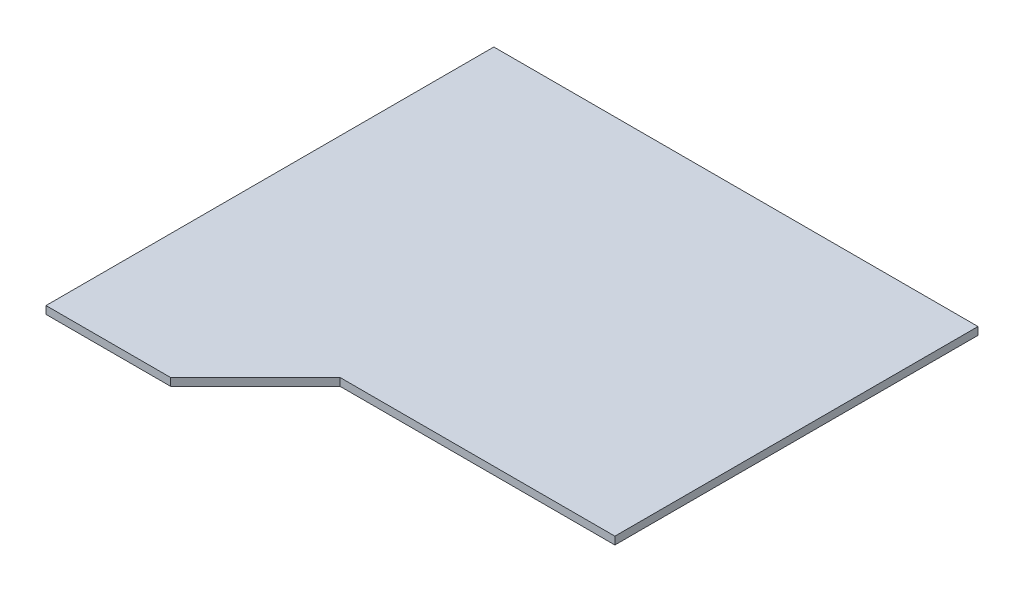
ISO-10303-21;
HEADER;
FILE_DESCRIPTION(('STEP AP214'),'2;1');
FILE_NAME('part.step','',(''),(''),'','','');
FILE_SCHEMA(('AUTOMOTIVE_DESIGN { 1 0 10303 214 1 1 1 1 }'));
ENDSEC;
DATA;
#1=APPLICATION_CONTEXT('core data for automotive mechanical design processes');
#2=APPLICATION_PROTOCOL_DEFINITION('international standard','automotive_design',2000,#1);
#3=PRODUCT_CONTEXT('',#1,'mechanical');
#4=PRODUCT('Part','Part','',(#3));
#5=PRODUCT_RELATED_PRODUCT_CATEGORY('part','',(#4));
#6=PRODUCT_DEFINITION_FORMATION('','',#4);
#7=PRODUCT_DEFINITION_CONTEXT('part definition',#1,'design');
#8=PRODUCT_DEFINITION('design','',#6,#7);
#9=PRODUCT_DEFINITION_SHAPE('','',#8);
#10=(LENGTH_UNIT() NAMED_UNIT(*) SI_UNIT(.MILLI.,.METRE.));
#11=(NAMED_UNIT(*) PLANE_ANGLE_UNIT() SI_UNIT($,.RADIAN.));
#12=(NAMED_UNIT(*) SI_UNIT($,.STERADIAN.) SOLID_ANGLE_UNIT());
#13=UNCERTAINTY_MEASURE_WITH_UNIT(LENGTH_MEASURE(1.E-05),#10,'distance_accuracy_value','');
#14=(GEOMETRIC_REPRESENTATION_CONTEXT(3) GLOBAL_UNCERTAINTY_ASSIGNED_CONTEXT((#13)) GLOBAL_UNIT_ASSIGNED_CONTEXT((#10,
#11,#12)) REPRESENTATION_CONTEXT('',''));
#15=CARTESIAN_POINT('',(0.,0.,0.));
#16=DIRECTION('',(0.,0.,1.));
#17=DIRECTION('',(1.,0.,0.));
#18=AXIS2_PLACEMENT_3D('',#15,#16,#17);
#19=CARTESIAN_POINT('',(0.,1.5875,-92.5));
#20=DIRECTION('',(1.,0.,0.));
#21=DIRECTION('',(0.,0.,-1.));
#22=AXIS2_PLACEMENT_3D('',#19,#20,#21);
#23=PLANE('',#22);
#24=DIRECTION('',(0.,0.,1.));
#25=VECTOR('',#24,1.);
#26=CARTESIAN_POINT('',(0.,0.,-92.5));
#27=LINE('',#26,#25);
#28=CARTESIAN_POINT('',(0.,0.,-92.5));
#29=VERTEX_POINT('',#28);
#30=CARTESIAN_POINT('',(0.,0.,0.));
#31=VERTEX_POINT('',#30);
#32=EDGE_CURVE('E116',#29,#31,#27,.T.);
#33=ORIENTED_EDGE('',*,*,#32,.T.);
#34=DIRECTION('',(0.,-1.,0.));
#35=VECTOR('',#34,1.);
#36=CARTESIAN_POINT('',(0.,1.5875,0.));
#37=LINE('',#36,#35);
#38=CARTESIAN_POINT('',(0.,1.5875,0.));
#39=VERTEX_POINT('',#38);
#40=EDGE_CURVE('E11',#39,#31,#37,.T.);
#41=ORIENTED_EDGE('',*,*,#40,.F.);
#42=DIRECTION('',(0.,0.,1.));
#43=VECTOR('',#42,1.);
#44=CARTESIAN_POINT('',(0.,1.5875,-92.5));
#45=LINE('',#44,#43);
#46=CARTESIAN_POINT('',(0.,1.5875,-92.5));
#47=VERTEX_POINT('',#46);
#48=EDGE_CURVE('E126',#47,#39,#45,.T.);
#49=ORIENTED_EDGE('',*,*,#48,.F.);
#50=DIRECTION('',(0.,-1.,0.));
#51=VECTOR('',#50,1.);
#52=CARTESIAN_POINT('',(0.,1.5875,-92.5));
#53=LINE('',#52,#51);
#54=EDGE_CURVE('E112',#47,#29,#53,.T.);
#55=ORIENTED_EDGE('',*,*,#54,.T.);
#56=EDGE_LOOP('',(#33,#41,#49,#55));
#57=FACE_BOUND('',#56,.T.);
#58=ADVANCED_FACE('F32',(#57),#23,.F.);
#59=CARTESIAN_POINT('',(0.,1.5875,0.));
#60=DIRECTION('',(0.,0.,-1.));
#61=DIRECTION('',(-1.,0.,0.));
#62=AXIS2_PLACEMENT_3D('',#59,#60,#61);
#63=PLANE('',#62);
#64=DIRECTION('',(1.,0.,0.));
#65=VECTOR('',#64,1.);
#66=CARTESIAN_POINT('',(0.,0.,0.));
#67=LINE('',#66,#65);
#68=CARTESIAN_POINT('',(25.75,0.,0.));
#69=VERTEX_POINT('',#68);
#70=EDGE_CURVE('E119',#31,#69,#67,.T.);
#71=ORIENTED_EDGE('',*,*,#70,.T.);
#72=DIRECTION('',(0.,-1.,0.));
#73=VECTOR('',#72,1.);
#74=CARTESIAN_POINT('',(25.75,1.5875,0.));
#75=LINE('',#74,#73);
#76=CARTESIAN_POINT('',(25.75,1.5875,0.));
#77=VERTEX_POINT('',#76);
#78=EDGE_CURVE('E40',#77,#69,#75,.T.);
#79=ORIENTED_EDGE('',*,*,#78,.F.);
#80=DIRECTION('',(1.,0.,0.));
#81=VECTOR('',#80,1.);
#82=CARTESIAN_POINT('',(0.,1.5875,0.));
#83=LINE('',#82,#81);
#84=EDGE_CURVE('E85',#39,#77,#83,.T.);
#85=ORIENTED_EDGE('',*,*,#84,.F.);
#86=ORIENTED_EDGE('',*,*,#40,.T.);
#87=EDGE_LOOP('',(#71,#79,#85,#86));
#88=FACE_BOUND('',#87,.T.);
#89=ADVANCED_FACE('F150',(#88),#63,.F.);
#90=CARTESIAN_POINT('',(25.75,1.5875,0.));
#91=DIRECTION('',(-0.707106781186547,0.,-0.707106781186548));
#92=DIRECTION('',(-0.707106781186548,0.,0.707106781186547));
#93=AXIS2_PLACEMENT_3D('',#90,#91,#92);
#94=PLANE('',#93);
#95=DIRECTION('',(0.707106781186548,0.,-0.707106781186547));
#96=VECTOR('',#95,1.);
#97=CARTESIAN_POINT('',(25.75,0.,0.));
#98=LINE('',#97,#96);
#99=CARTESIAN_POINT('',(43.25,0.,-17.5));
#100=VERTEX_POINT('',#99);
#101=EDGE_CURVE('E121',#69,#100,#98,.T.);
#102=ORIENTED_EDGE('',*,*,#101,.T.);
#103=DIRECTION('',(0.,-1.,0.));
#104=VECTOR('',#103,1.);
#105=CARTESIAN_POINT('',(43.25,1.5875,-17.5));
#106=LINE('',#105,#104);
#107=CARTESIAN_POINT('',(43.25,1.5875,-17.5));
#108=VERTEX_POINT('',#107);
#109=EDGE_CURVE('E107',#108,#100,#106,.T.);
#110=ORIENTED_EDGE('',*,*,#109,.F.);
#111=DIRECTION('',(0.707106781186548,0.,-0.707106781186547));
#112=VECTOR('',#111,1.);
#113=CARTESIAN_POINT('',(25.75,1.5875,0.));
#114=LINE('',#113,#112);
#115=EDGE_CURVE('E98',#77,#108,#114,.T.);
#116=ORIENTED_EDGE('',*,*,#115,.F.);
#117=ORIENTED_EDGE('',*,*,#78,.T.);
#118=EDGE_LOOP('',(#102,#110,#116,#117));
#119=FACE_BOUND('',#118,.T.);
#120=ADVANCED_FACE('F132',(#119),#94,.F.);
#121=CARTESIAN_POINT('',(43.25,1.5875,-17.5));
#122=DIRECTION('',(0.,0.,-1.));
#123=DIRECTION('',(-1.,0.,0.));
#124=AXIS2_PLACEMENT_3D('',#121,#122,#123);
#125=PLANE('',#124);
#126=DIRECTION('',(1.,0.,0.));
#127=VECTOR('',#126,1.);
#128=CARTESIAN_POINT('',(43.25,0.,-17.5));
#129=LINE('',#128,#127);
#130=CARTESIAN_POINT('',(100.,0.,-17.5));
#131=VERTEX_POINT('',#130);
#132=EDGE_CURVE('E106',#100,#131,#129,.T.);
#133=ORIENTED_EDGE('',*,*,#132,.T.);
#134=DIRECTION('',(0.,-1.,0.));
#135=VECTOR('',#134,1.);
#136=CARTESIAN_POINT('',(100.,1.5875,-17.5));
#137=LINE('',#136,#135);
#138=CARTESIAN_POINT('',(100.,1.5875,-17.5));
#139=VERTEX_POINT('',#138);
#140=EDGE_CURVE('E103',#139,#131,#137,.T.);
#141=ORIENTED_EDGE('',*,*,#140,.F.);
#142=DIRECTION('',(1.,0.,0.));
#143=VECTOR('',#142,1.);
#144=CARTESIAN_POINT('',(43.25,1.5875,-17.5));
#145=LINE('',#144,#143);
#146=EDGE_CURVE('E92',#108,#139,#145,.T.);
#147=ORIENTED_EDGE('',*,*,#146,.F.);
#148=ORIENTED_EDGE('',*,*,#109,.T.);
#149=EDGE_LOOP('',(#133,#141,#147,#148));
#150=FACE_BOUND('',#149,.T.);
#151=ADVANCED_FACE('F104',(#150),#125,.F.);
#152=CARTESIAN_POINT('',(100.,1.5875,-17.5));
#153=DIRECTION('',(-1.,0.,0.));
#154=DIRECTION('',(0.,0.,1.));
#155=AXIS2_PLACEMENT_3D('',#152,#153,#154);
#156=PLANE('',#155);
#157=DIRECTION('',(0.,0.,-1.));
#158=VECTOR('',#157,1.);
#159=CARTESIAN_POINT('',(100.,0.,-17.5));
#160=LINE('',#159,#158);
#161=CARTESIAN_POINT('',(100.,0.,-92.5));
#162=VERTEX_POINT('',#161);
#163=EDGE_CURVE('E71',#131,#162,#160,.T.);
#164=ORIENTED_EDGE('',*,*,#163,.T.);
#165=DIRECTION('',(0.,-1.,0.));
#166=VECTOR('',#165,1.);
#167=CARTESIAN_POINT('',(100.,1.5875,-92.5));
#168=LINE('',#167,#166);
#169=CARTESIAN_POINT('',(100.,1.5875,-92.5));
#170=VERTEX_POINT('',#169);
#171=EDGE_CURVE('E108',#170,#162,#168,.T.);
#172=ORIENTED_EDGE('',*,*,#171,.F.);
#173=DIRECTION('',(0.,0.,-1.));
#174=VECTOR('',#173,1.);
#175=CARTESIAN_POINT('',(100.,1.5875,-17.5));
#176=LINE('',#175,#174);
#177=EDGE_CURVE('E96',#139,#170,#176,.T.);
#178=ORIENTED_EDGE('',*,*,#177,.F.);
#179=ORIENTED_EDGE('',*,*,#140,.T.);
#180=EDGE_LOOP('',(#164,#172,#178,#179));
#181=FACE_BOUND('',#180,.T.);
#182=ADVANCED_FACE('F110',(#181),#156,.F.);
#183=CARTESIAN_POINT('',(100.,1.5875,-92.5));
#184=DIRECTION('',(0.,0.,1.));
#185=DIRECTION('',(1.,0.,0.));
#186=AXIS2_PLACEMENT_3D('',#183,#184,#185);
#187=PLANE('',#186);
#188=DIRECTION('',(-1.,0.,0.));
#189=VECTOR('',#188,1.);
#190=CARTESIAN_POINT('',(100.,0.,-92.5));
#191=LINE('',#190,#189);
#192=EDGE_CURVE('E77',#162,#29,#191,.T.);
#193=ORIENTED_EDGE('',*,*,#192,.T.);
#194=ORIENTED_EDGE('',*,*,#54,.F.);
#195=DIRECTION('',(-1.,0.,0.));
#196=VECTOR('',#195,1.);
#197=CARTESIAN_POINT('',(100.,1.5875,-92.5));
#198=LINE('',#197,#196);
#199=EDGE_CURVE('E48',#170,#47,#198,.T.);
#200=ORIENTED_EDGE('',*,*,#199,.F.);
#201=ORIENTED_EDGE('',*,*,#171,.T.);
#202=EDGE_LOOP('',(#193,#194,#200,#201));
#203=FACE_BOUND('',#202,.T.);
#204=ADVANCED_FACE('F139',(#203),#187,.F.);
#205=CARTESIAN_POINT('',(0.,1.5875,0.));
#206=DIRECTION('',(0.,1.,0.));
#207=DIRECTION('',(0.,0.,1.));
#208=AXIS2_PLACEMENT_3D('',#205,#206,#207);
#209=PLANE('',#208);
#210=ORIENTED_EDGE('',*,*,#48,.T.);
#211=ORIENTED_EDGE('',*,*,#84,.T.);
#212=ORIENTED_EDGE('',*,*,#115,.T.);
#213=ORIENTED_EDGE('',*,*,#146,.T.);
#214=ORIENTED_EDGE('',*,*,#177,.T.);
#215=ORIENTED_EDGE('',*,*,#199,.T.);
#216=EDGE_LOOP('',(#210,#211,#212,#213,#214,#215));
#217=FACE_BOUND('',#216,.T.);
#218=ADVANCED_FACE('F94',(#217),#209,.T.);
#219=CARTESIAN_POINT('',(0.,0.,0.));
#220=DIRECTION('',(0.,1.,0.));
#221=DIRECTION('',(0.,0.,1.));
#222=AXIS2_PLACEMENT_3D('',#219,#220,#221);
#223=PLANE('',#222);
#224=ORIENTED_EDGE('',*,*,#32,.F.);
#225=ORIENTED_EDGE('',*,*,#192,.F.);
#226=ORIENTED_EDGE('',*,*,#163,.F.);
#227=ORIENTED_EDGE('',*,*,#132,.F.);
#228=ORIENTED_EDGE('',*,*,#101,.F.);
#229=ORIENTED_EDGE('',*,*,#70,.F.);
#230=EDGE_LOOP('',(#224,#225,#226,#227,#228,#229));
#231=FACE_BOUND('',#230,.T.);
#232=ADVANCED_FACE('F135',(#231),#223,.F.);
#233=CLOSED_SHELL('',(#58,#89,#120,#151,#182,#204,#218,#232));
#234=MANIFOLD_SOLID_BREP('B2',#233);
#235=ADVANCED_BREP_SHAPE_REPRESENTATION('',(#18,#234),#14);
#236=SHAPE_DEFINITION_REPRESENTATION(#9,#235);
ENDSEC;
END-ISO-10303-21;
